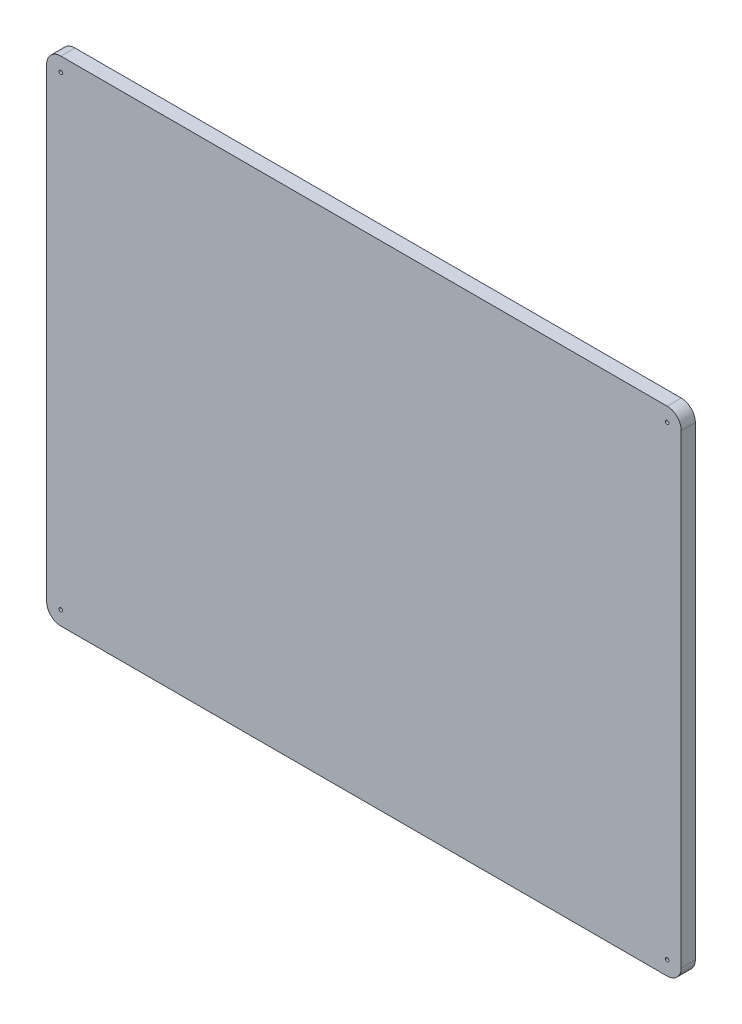
ISO-10303-21;
HEADER;
FILE_DESCRIPTION(('STEP AP214'),'2;1');
FILE_NAME('part.step','',(''),(''),'','','');
FILE_SCHEMA(('AUTOMOTIVE_DESIGN { 1 0 10303 214 1 1 1 1 }'));
ENDSEC;
DATA;
#1=APPLICATION_CONTEXT('core data for automotive mechanical design processes');
#2=APPLICATION_PROTOCOL_DEFINITION('international standard','automotive_design',2000,#1);
#3=PRODUCT_CONTEXT('',#1,'mechanical');
#4=PRODUCT('Part','Part','',(#3));
#5=PRODUCT_RELATED_PRODUCT_CATEGORY('part','',(#4));
#6=PRODUCT_DEFINITION_FORMATION('','',#4);
#7=PRODUCT_DEFINITION_CONTEXT('part definition',#1,'design');
#8=PRODUCT_DEFINITION('design','',#6,#7);
#9=PRODUCT_DEFINITION_SHAPE('','',#8);
#10=(LENGTH_UNIT() NAMED_UNIT(*) SI_UNIT(.MILLI.,.METRE.));
#11=(NAMED_UNIT(*) PLANE_ANGLE_UNIT() SI_UNIT($,.RADIAN.));
#12=(NAMED_UNIT(*) SI_UNIT($,.STERADIAN.) SOLID_ANGLE_UNIT());
#13=UNCERTAINTY_MEASURE_WITH_UNIT(LENGTH_MEASURE(1.E-05),#10,'distance_accuracy_value','');
#14=(GEOMETRIC_REPRESENTATION_CONTEXT(3) GLOBAL_UNCERTAINTY_ASSIGNED_CONTEXT((#13)) GLOBAL_UNIT_ASSIGNED_CONTEXT((#10,
#11,#12)) REPRESENTATION_CONTEXT('',''));
#15=CARTESIAN_POINT('',(0.,0.,0.));
#16=DIRECTION('',(0.,0.,1.));
#17=DIRECTION('',(1.,0.,0.));
#18=AXIS2_PLACEMENT_3D('',#15,#16,#17);
#19=CARTESIAN_POINT('',(57.15,-44.45,2.54));
#20=DIRECTION('',(-1.,0.,0.));
#21=DIRECTION('',(0.,0.,1.));
#22=AXIS2_PLACEMENT_3D('',#19,#20,#21);
#23=PLANE('',#22);
#24=DIRECTION('',(0.,1.,0.));
#25=VECTOR('',#24,1.);
#26=CARTESIAN_POINT('',(57.15,-44.45,0.));
#27=LINE('',#26,#25);
#28=CARTESIAN_POINT('',(57.15,-41.91,0.));
#29=VERTEX_POINT('',#28);
#30=CARTESIAN_POINT('',(57.15,41.91,0.));
#31=VERTEX_POINT('',#30);
#32=EDGE_CURVE('E156',#29,#31,#27,.T.);
#33=ORIENTED_EDGE('',*,*,#32,.T.);
#34=DIRECTION('',(0.,0.,-1.));
#35=VECTOR('',#34,1.);
#36=CARTESIAN_POINT('',(57.15,41.91,2.54));
#37=LINE('',#36,#35);
#38=CARTESIAN_POINT('',(57.15,41.91,2.54));
#39=VERTEX_POINT('',#38);
#40=EDGE_CURVE('E11',#31,#39,#37,.F.);
#41=ORIENTED_EDGE('',*,*,#40,.T.);
#42=DIRECTION('',(0.,1.,0.));
#43=VECTOR('',#42,1.);
#44=CARTESIAN_POINT('',(57.15,-44.45,2.54));
#45=LINE('',#44,#43);
#46=CARTESIAN_POINT('',(57.15,-41.91,2.54));
#47=VERTEX_POINT('',#46);
#48=EDGE_CURVE('E124',#47,#39,#45,.T.);
#49=ORIENTED_EDGE('',*,*,#48,.F.);
#50=DIRECTION('',(0.,0.,-1.));
#51=VECTOR('',#50,1.);
#52=CARTESIAN_POINT('',(57.15,-41.91,2.54));
#53=LINE('',#52,#51);
#54=EDGE_CURVE('E40',#47,#29,#53,.T.);
#55=ORIENTED_EDGE('',*,*,#54,.T.);
#56=EDGE_LOOP('',(#33,#41,#49,#55));
#57=FACE_BOUND('',#56,.T.);
#58=ADVANCED_FACE('F32',(#57),#23,.F.);
#59=CARTESIAN_POINT('',(-57.15,44.45,2.54));
#60=DIRECTION('',(0.,-1.,0.));
#61=DIRECTION('',(0.,0.,-1.));
#62=AXIS2_PLACEMENT_3D('',#59,#60,#61);
#63=PLANE('',#62);
#64=DIRECTION('',(-1.,0.,0.));
#65=VECTOR('',#64,1.);
#66=CARTESIAN_POINT('',(-57.15,44.45,0.));
#67=LINE('',#66,#65);
#68=CARTESIAN_POINT('',(54.61,44.45,0.));
#69=VERTEX_POINT('',#68);
#70=CARTESIAN_POINT('',(-54.61,44.45,0.));
#71=VERTEX_POINT('',#70);
#72=EDGE_CURVE('E129',#69,#71,#67,.T.);
#73=ORIENTED_EDGE('',*,*,#72,.T.);
#74=DIRECTION('',(0.,0.,-1.));
#75=VECTOR('',#74,1.);
#76=CARTESIAN_POINT('',(-54.61,44.45,2.54));
#77=LINE('',#76,#75);
#78=CARTESIAN_POINT('',(-54.61,44.45,2.54));
#79=VERTEX_POINT('',#78);
#80=EDGE_CURVE('E47',#71,#79,#77,.F.);
#81=ORIENTED_EDGE('',*,*,#80,.T.);
#82=DIRECTION('',(-1.,0.,0.));
#83=VECTOR('',#82,1.);
#84=CARTESIAN_POINT('',(-57.15,44.45,2.54));
#85=LINE('',#84,#83);
#86=CARTESIAN_POINT('',(54.61,44.45,2.54));
#87=VERTEX_POINT('',#86);
#88=EDGE_CURVE('E127',#87,#79,#85,.T.);
#89=ORIENTED_EDGE('',*,*,#88,.F.);
#90=DIRECTION('',(0.,0.,-1.));
#91=VECTOR('',#90,1.);
#92=CARTESIAN_POINT('',(54.61,44.45,2.54));
#93=LINE('',#92,#91);
#94=EDGE_CURVE('E148',#87,#69,#93,.T.);
#95=ORIENTED_EDGE('',*,*,#94,.T.);
#96=EDGE_LOOP('',(#73,#81,#89,#95));
#97=FACE_BOUND('',#96,.T.);
#98=ADVANCED_FACE('F211',(#97),#63,.F.);
#99=CARTESIAN_POINT('',(-57.15,-44.45,2.54));
#100=DIRECTION('',(1.,0.,0.));
#101=DIRECTION('',(0.,0.,-1.));
#102=AXIS2_PLACEMENT_3D('',#99,#100,#101);
#103=PLANE('',#102);
#104=DIRECTION('',(0.,-1.,0.));
#105=VECTOR('',#104,1.);
#106=CARTESIAN_POINT('',(-57.15,-44.45,0.));
#107=LINE('',#106,#105);
#108=CARTESIAN_POINT('',(-57.15,41.91,0.));
#109=VERTEX_POINT('',#108);
#110=CARTESIAN_POINT('',(-57.15,-41.91,0.));
#111=VERTEX_POINT('',#110);
#112=EDGE_CURVE('E125',#109,#111,#107,.T.);
#113=ORIENTED_EDGE('',*,*,#112,.T.);
#114=DIRECTION('',(0.,0.,-1.));
#115=VECTOR('',#114,1.);
#116=CARTESIAN_POINT('',(-57.15,-41.91,2.54));
#117=LINE('',#116,#115);
#118=CARTESIAN_POINT('',(-57.15,-41.91,2.54));
#119=VERTEX_POINT('',#118);
#120=EDGE_CURVE('E103',#111,#119,#117,.F.);
#121=ORIENTED_EDGE('',*,*,#120,.T.);
#122=DIRECTION('',(0.,-1.,0.));
#123=VECTOR('',#122,1.);
#124=CARTESIAN_POINT('',(-57.15,-44.45,2.54));
#125=LINE('',#124,#123);
#126=CARTESIAN_POINT('',(-57.15,41.91,2.54));
#127=VERTEX_POINT('',#126);
#128=EDGE_CURVE('E168',#127,#119,#125,.T.);
#129=ORIENTED_EDGE('',*,*,#128,.F.);
#130=DIRECTION('',(0.,0.,-1.));
#131=VECTOR('',#130,1.);
#132=CARTESIAN_POINT('',(-57.15,41.91,2.54));
#133=LINE('',#132,#131);
#134=EDGE_CURVE('E108',#127,#109,#133,.T.);
#135=ORIENTED_EDGE('',*,*,#134,.T.);
#136=EDGE_LOOP('',(#113,#121,#129,#135));
#137=FACE_BOUND('',#136,.T.);
#138=ADVANCED_FACE('F208',(#137),#103,.F.);
#139=CARTESIAN_POINT('',(-57.15,-44.45,2.54));
#140=DIRECTION('',(0.,1.,0.));
#141=DIRECTION('',(0.,0.,1.));
#142=AXIS2_PLACEMENT_3D('',#139,#140,#141);
#143=PLANE('',#142);
#144=DIRECTION('',(1.,0.,0.));
#145=VECTOR('',#144,1.);
#146=CARTESIAN_POINT('',(-57.15,-44.45,2.54));
#147=LINE('',#146,#145);
#148=CARTESIAN_POINT('',(-54.61,-44.45,2.54));
#149=VERTEX_POINT('',#148);
#150=CARTESIAN_POINT('',(54.61,-44.45,2.54));
#151=VERTEX_POINT('',#150);
#152=EDGE_CURVE('E118',#149,#151,#147,.T.);
#153=ORIENTED_EDGE('',*,*,#152,.F.);
#154=DIRECTION('',(0.,0.,-1.));
#155=VECTOR('',#154,1.);
#156=CARTESIAN_POINT('',(-54.61,-44.45,2.54));
#157=LINE('',#156,#155);
#158=CARTESIAN_POINT('',(-54.61,-44.45,0.));
#159=VERTEX_POINT('',#158);
#160=EDGE_CURVE('E102',#149,#159,#157,.T.);
#161=ORIENTED_EDGE('',*,*,#160,.T.);
#162=DIRECTION('',(1.,0.,0.));
#163=VECTOR('',#162,1.);
#164=CARTESIAN_POINT('',(-57.15,-44.45,0.));
#165=LINE('',#164,#163);
#166=CARTESIAN_POINT('',(54.61,-44.45,0.));
#167=VERTEX_POINT('',#166);
#168=EDGE_CURVE('E115',#159,#167,#165,.T.);
#169=ORIENTED_EDGE('',*,*,#168,.T.);
#170=DIRECTION('',(0.,0.,-1.));
#171=VECTOR('',#170,1.);
#172=CARTESIAN_POINT('',(54.61,-44.45,2.54));
#173=LINE('',#172,#171);
#174=EDGE_CURVE('E120',#167,#151,#173,.F.);
#175=ORIENTED_EDGE('',*,*,#174,.T.);
#176=EDGE_LOOP('',(#153,#161,#169,#175));
#177=FACE_BOUND('',#176,.T.);
#178=ADVANCED_FACE('F114',(#177),#143,.F.);
#179=CARTESIAN_POINT('',(0.,0.,2.54));
#180=DIRECTION('',(0.,0.,-1.));
#181=DIRECTION('',(-1.,0.,0.));
#182=AXIS2_PLACEMENT_3D('',#179,#180,#181);
#183=PLANE('',#182);
#184=CARTESIAN_POINT('',(54.61,41.91,2.54));
#185=DIRECTION('',(0.,0.,1.));
#186=DIRECTION('',(1.,0.,0.));
#187=AXIS2_PLACEMENT_3D('',#184,#185,#186);
#188=CIRCLE('',#187,0.317500000000001);
#189=CARTESIAN_POINT('',(54.9275,41.91,2.54));
#190=VERTEX_POINT('',#189);
#191=EDGE_CURVE('E173',#190,#190,#188,.T.);
#192=ORIENTED_EDGE('',*,*,#191,.F.);
#193=EDGE_LOOP('',(#192));
#194=FACE_BOUND('',#193,.T.);
#195=CARTESIAN_POINT('',(54.61,-41.91,2.54));
#196=DIRECTION('',(0.,0.,1.));
#197=DIRECTION('',(1.,0.,0.));
#198=AXIS2_PLACEMENT_3D('',#195,#196,#197);
#199=CIRCLE('',#198,0.317500000000001);
#200=CARTESIAN_POINT('',(54.9275,-41.91,2.54));
#201=VERTEX_POINT('',#200);
#202=EDGE_CURVE('E184',#201,#201,#199,.T.);
#203=ORIENTED_EDGE('',*,*,#202,.F.);
#204=EDGE_LOOP('',(#203));
#205=FACE_BOUND('',#204,.T.);
#206=CARTESIAN_POINT('',(-54.61,-41.91,2.54));
#207=DIRECTION('',(0.,0.,1.));
#208=DIRECTION('',(1.,0.,0.));
#209=AXIS2_PLACEMENT_3D('',#206,#207,#208);
#210=CIRCLE('',#209,0.317500000000001);
#211=CARTESIAN_POINT('',(-54.2925,-41.91,2.54));
#212=VERTEX_POINT('',#211);
#213=EDGE_CURVE('E178',#212,#212,#210,.T.);
#214=ORIENTED_EDGE('',*,*,#213,.F.);
#215=EDGE_LOOP('',(#214));
#216=FACE_BOUND('',#215,.T.);
#217=CARTESIAN_POINT('',(-54.61,41.91,2.54));
#218=DIRECTION('',(0.,0.,1.));
#219=DIRECTION('',(1.,0.,0.));
#220=AXIS2_PLACEMENT_3D('',#217,#218,#219);
#221=CIRCLE('',#220,0.317500000000001);
#222=CARTESIAN_POINT('',(-54.2925,41.91,2.54));
#223=VERTEX_POINT('',#222);
#224=EDGE_CURVE('E161',#223,#223,#221,.T.);
#225=ORIENTED_EDGE('',*,*,#224,.F.);
#226=EDGE_LOOP('',(#225));
#227=FACE_BOUND('',#226,.T.);
#228=ORIENTED_EDGE('',*,*,#128,.T.);
#229=CARTESIAN_POINT('',(-54.61,-41.91,2.54));
#230=DIRECTION('',(0.,0.,-1.));
#231=DIRECTION('',(-1.,0.,0.));
#232=AXIS2_PLACEMENT_3D('',#229,#230,#231);
#233=CIRCLE('',#232,2.54);
#234=EDGE_CURVE('E146',#119,#149,#233,.F.);
#235=ORIENTED_EDGE('',*,*,#234,.T.);
#236=ORIENTED_EDGE('',*,*,#152,.T.);
#237=CARTESIAN_POINT('',(54.61,-41.91,2.54));
#238=DIRECTION('',(0.,0.,-1.));
#239=DIRECTION('',(-1.,0.,0.));
#240=AXIS2_PLACEMENT_3D('',#237,#238,#239);
#241=CIRCLE('',#240,2.54);
#242=EDGE_CURVE('E141',#151,#47,#241,.F.);
#243=ORIENTED_EDGE('',*,*,#242,.T.);
#244=ORIENTED_EDGE('',*,*,#48,.T.);
#245=CARTESIAN_POINT('',(54.61,41.91,2.54));
#246=DIRECTION('',(0.,0.,-1.));
#247=DIRECTION('',(-1.,0.,0.));
#248=AXIS2_PLACEMENT_3D('',#245,#246,#247);
#249=CIRCLE('',#248,2.54);
#250=EDGE_CURVE('E54',#39,#87,#249,.F.);
#251=ORIENTED_EDGE('',*,*,#250,.T.);
#252=ORIENTED_EDGE('',*,*,#88,.T.);
#253=CARTESIAN_POINT('',(-54.61,41.91,2.54));
#254=DIRECTION('',(0.,0.,-1.));
#255=DIRECTION('',(-1.,0.,0.));
#256=AXIS2_PLACEMENT_3D('',#253,#254,#255);
#257=CIRCLE('',#256,2.54);
#258=EDGE_CURVE('E144',#79,#127,#257,.F.);
#259=ORIENTED_EDGE('',*,*,#258,.T.);
#260=EDGE_LOOP('',(#228,#235,#236,#243,#244,#251,#252,#259));
#261=FACE_BOUND('',#260,.T.);
#262=ADVANCED_FACE('F195',(#194,#205,#216,#227,#261),#183,.F.);
#263=CARTESIAN_POINT('',(0.,0.,0.));
#264=DIRECTION('',(0.,0.,-1.));
#265=DIRECTION('',(-1.,0.,0.));
#266=AXIS2_PLACEMENT_3D('',#263,#264,#265);
#267=PLANE('',#266);
#268=CARTESIAN_POINT('',(54.61,41.91,0.));
#269=DIRECTION('',(0.,0.,-1.));
#270=DIRECTION('',(-1.,0.,0.));
#271=AXIS2_PLACEMENT_3D('',#268,#269,#270);
#272=CIRCLE('',#271,0.317500000000001);
#273=CARTESIAN_POINT('',(54.2925,41.91,0.));
#274=VERTEX_POINT('',#273);
#275=EDGE_CURVE('E187',#274,#274,#272,.F.);
#276=ORIENTED_EDGE('',*,*,#275,.T.);
#277=EDGE_LOOP('',(#276));
#278=FACE_BOUND('',#277,.T.);
#279=CARTESIAN_POINT('',(54.61,-41.91,0.));
#280=DIRECTION('',(0.,0.,-1.));
#281=DIRECTION('',(-1.,0.,0.));
#282=AXIS2_PLACEMENT_3D('',#279,#280,#281);
#283=CIRCLE('',#282,0.317500000000001);
#284=CARTESIAN_POINT('',(54.2925,-41.91,0.));
#285=VERTEX_POINT('',#284);
#286=EDGE_CURVE('E181',#285,#285,#283,.F.);
#287=ORIENTED_EDGE('',*,*,#286,.T.);
#288=EDGE_LOOP('',(#287));
#289=FACE_BOUND('',#288,.T.);
#290=CARTESIAN_POINT('',(-54.61,-41.91,0.));
#291=DIRECTION('',(0.,0.,-1.));
#292=DIRECTION('',(-1.,0.,0.));
#293=AXIS2_PLACEMENT_3D('',#290,#291,#292);
#294=CIRCLE('',#293,0.317500000000001);
#295=CARTESIAN_POINT('',(-54.9275,-41.91,0.));
#296=VERTEX_POINT('',#295);
#297=EDGE_CURVE('E175',#296,#296,#294,.F.);
#298=ORIENTED_EDGE('',*,*,#297,.T.);
#299=EDGE_LOOP('',(#298));
#300=FACE_BOUND('',#299,.T.);
#301=CARTESIAN_POINT('',(-54.61,41.91,0.));
#302=DIRECTION('',(0.,0.,-1.));
#303=DIRECTION('',(-1.,0.,0.));
#304=AXIS2_PLACEMENT_3D('',#301,#302,#303);
#305=CIRCLE('',#304,0.317500000000001);
#306=CARTESIAN_POINT('',(-54.9275,41.91,0.));
#307=VERTEX_POINT('',#306);
#308=EDGE_CURVE('E164',#307,#307,#305,.F.);
#309=ORIENTED_EDGE('',*,*,#308,.T.);
#310=EDGE_LOOP('',(#309));
#311=FACE_BOUND('',#310,.T.);
#312=ORIENTED_EDGE('',*,*,#168,.F.);
#313=CARTESIAN_POINT('',(-54.61,-41.91,0.));
#314=DIRECTION('',(0.,0.,-1.));
#315=DIRECTION('',(-1.,0.,0.));
#316=AXIS2_PLACEMENT_3D('',#313,#314,#315);
#317=CIRCLE('',#316,2.54);
#318=EDGE_CURVE('E98',#159,#111,#317,.T.);
#319=ORIENTED_EDGE('',*,*,#318,.T.);
#320=ORIENTED_EDGE('',*,*,#112,.F.);
#321=CARTESIAN_POINT('',(-54.61,41.91,0.));
#322=DIRECTION('',(0.,0.,-1.));
#323=DIRECTION('',(-1.,0.,0.));
#324=AXIS2_PLACEMENT_3D('',#321,#322,#323);
#325=CIRCLE('',#324,2.54);
#326=EDGE_CURVE('E109',#109,#71,#325,.T.);
#327=ORIENTED_EDGE('',*,*,#326,.T.);
#328=ORIENTED_EDGE('',*,*,#72,.F.);
#329=CARTESIAN_POINT('',(54.61,41.91,0.));
#330=DIRECTION('',(0.,0.,-1.));
#331=DIRECTION('',(-1.,0.,0.));
#332=AXIS2_PLACEMENT_3D('',#329,#330,#331);
#333=CIRCLE('',#332,2.54);
#334=EDGE_CURVE('E135',#69,#31,#333,.T.);
#335=ORIENTED_EDGE('',*,*,#334,.T.);
#336=ORIENTED_EDGE('',*,*,#32,.F.);
#337=CARTESIAN_POINT('',(54.61,-41.91,0.));
#338=DIRECTION('',(0.,0.,-1.));
#339=DIRECTION('',(-1.,0.,0.));
#340=AXIS2_PLACEMENT_3D('',#337,#338,#339);
#341=CIRCLE('',#340,2.54);
#342=EDGE_CURVE('E119',#29,#167,#341,.T.);
#343=ORIENTED_EDGE('',*,*,#342,.T.);
#344=EDGE_LOOP('',(#312,#319,#320,#327,#328,#335,#336,#343));
#345=FACE_BOUND('',#344,.T.);
#346=ADVANCED_FACE('F122',(#278,#289,#300,#311,#345),#267,.T.);
#347=CARTESIAN_POINT('',(-54.61,-41.91,2.54));
#348=DIRECTION('',(0.,0.,-1.));
#349=DIRECTION('',(-1.,0.,0.));
#350=AXIS2_PLACEMENT_3D('',#347,#348,#349);
#351=CYLINDRICAL_SURFACE('',#350,2.54);
#352=ORIENTED_EDGE('',*,*,#234,.F.);
#353=ORIENTED_EDGE('',*,*,#120,.F.);
#354=ORIENTED_EDGE('',*,*,#318,.F.);
#355=ORIENTED_EDGE('',*,*,#160,.F.);
#356=EDGE_LOOP('',(#352,#353,#354,#355));
#357=FACE_BOUND('',#356,.T.);
#358=ADVANCED_FACE('F101',(#357),#351,.T.);
#359=CARTESIAN_POINT('',(-54.61,41.91,2.54));
#360=DIRECTION('',(0.,0.,-1.));
#361=DIRECTION('',(-1.,0.,0.));
#362=AXIS2_PLACEMENT_3D('',#359,#360,#361);
#363=CYLINDRICAL_SURFACE('',#362,2.54);
#364=ORIENTED_EDGE('',*,*,#258,.F.);
#365=ORIENTED_EDGE('',*,*,#80,.F.);
#366=ORIENTED_EDGE('',*,*,#326,.F.);
#367=ORIENTED_EDGE('',*,*,#134,.F.);
#368=EDGE_LOOP('',(#364,#365,#366,#367));
#369=FACE_BOUND('',#368,.T.);
#370=ADVANCED_FACE('F210',(#369),#363,.T.);
#371=CARTESIAN_POINT('',(54.61,41.91,2.54));
#372=DIRECTION('',(0.,0.,-1.));
#373=DIRECTION('',(-1.,0.,0.));
#374=AXIS2_PLACEMENT_3D('',#371,#372,#373);
#375=CYLINDRICAL_SURFACE('',#374,2.54);
#376=ORIENTED_EDGE('',*,*,#250,.F.);
#377=ORIENTED_EDGE('',*,*,#40,.F.);
#378=ORIENTED_EDGE('',*,*,#334,.F.);
#379=ORIENTED_EDGE('',*,*,#94,.F.);
#380=EDGE_LOOP('',(#376,#377,#378,#379));
#381=FACE_BOUND('',#380,.T.);
#382=ADVANCED_FACE('F214',(#381),#375,.T.);
#383=CARTESIAN_POINT('',(54.61,-41.91,2.54));
#384=DIRECTION('',(0.,0.,-1.));
#385=DIRECTION('',(-1.,0.,0.));
#386=AXIS2_PLACEMENT_3D('',#383,#384,#385);
#387=CYLINDRICAL_SURFACE('',#386,2.54);
#388=ORIENTED_EDGE('',*,*,#242,.F.);
#389=ORIENTED_EDGE('',*,*,#174,.F.);
#390=ORIENTED_EDGE('',*,*,#342,.F.);
#391=ORIENTED_EDGE('',*,*,#54,.F.);
#392=EDGE_LOOP('',(#388,#389,#390,#391));
#393=FACE_BOUND('',#392,.T.);
#394=ADVANCED_FACE('F34',(#393),#387,.T.);
#395=CARTESIAN_POINT('',(-54.61,41.91,-0.00100000000000013));
#396=DIRECTION('',(0.,0.,1.));
#397=DIRECTION('',(1.,0.,0.));
#398=AXIS2_PLACEMENT_3D('',#395,#396,#397);
#399=CYLINDRICAL_SURFACE('',#398,0.317500000000001);
#400=ORIENTED_EDGE('',*,*,#308,.F.);
#401=EDGE_LOOP('',(#400));
#402=FACE_BOUND('',#401,.T.);
#403=ORIENTED_EDGE('',*,*,#224,.T.);
#404=EDGE_LOOP('',(#403));
#405=FACE_BOUND('',#404,.T.);
#406=ADVANCED_FACE('F216',(#402,#405),#399,.F.);
#407=CARTESIAN_POINT('',(-54.61,-41.91,-0.00100000000000013));
#408=DIRECTION('',(0.,0.,1.));
#409=DIRECTION('',(1.,0.,0.));
#410=AXIS2_PLACEMENT_3D('',#407,#408,#409);
#411=CYLINDRICAL_SURFACE('',#410,0.317500000000001);
#412=ORIENTED_EDGE('',*,*,#297,.F.);
#413=EDGE_LOOP('',(#412));
#414=FACE_BOUND('',#413,.T.);
#415=ORIENTED_EDGE('',*,*,#213,.T.);
#416=EDGE_LOOP('',(#415));
#417=FACE_BOUND('',#416,.T.);
#418=ADVANCED_FACE('F221',(#414,#417),#411,.F.);
#419=CARTESIAN_POINT('',(54.61,-41.91,-0.00100000000000013));
#420=DIRECTION('',(0.,0.,1.));
#421=DIRECTION('',(1.,0.,0.));
#422=AXIS2_PLACEMENT_3D('',#419,#420,#421);
#423=CYLINDRICAL_SURFACE('',#422,0.317500000000001);
#424=ORIENTED_EDGE('',*,*,#286,.F.);
#425=EDGE_LOOP('',(#424));
#426=FACE_BOUND('',#425,.T.);
#427=ORIENTED_EDGE('',*,*,#202,.T.);
#428=EDGE_LOOP('',(#427));
#429=FACE_BOUND('',#428,.T.);
#430=ADVANCED_FACE('F280',(#426,#429),#423,.F.);
#431=CARTESIAN_POINT('',(54.61,41.91,-0.00100000000000013));
#432=DIRECTION('',(0.,0.,1.));
#433=DIRECTION('',(1.,0.,0.));
#434=AXIS2_PLACEMENT_3D('',#431,#432,#433);
#435=CYLINDRICAL_SURFACE('',#434,0.317500000000001);
#436=ORIENTED_EDGE('',*,*,#275,.F.);
#437=EDGE_LOOP('',(#436));
#438=FACE_BOUND('',#437,.T.);
#439=ORIENTED_EDGE('',*,*,#191,.T.);
#440=EDGE_LOOP('',(#439));
#441=FACE_BOUND('',#440,.T.);
#442=ADVANCED_FACE('F193',(#438,#441),#435,.F.);
#443=CLOSED_SHELL('',(#58,#98,#138,#178,#262,#346,#358,#370,#382,#394,#406,#418,#430,#442));
#444=MANIFOLD_SOLID_BREP('B2',#443);
#445=ADVANCED_BREP_SHAPE_REPRESENTATION('',(#18,#444),#14);
#446=SHAPE_DEFINITION_REPRESENTATION(#9,#445);
ENDSEC;
END-ISO-10303-21;
